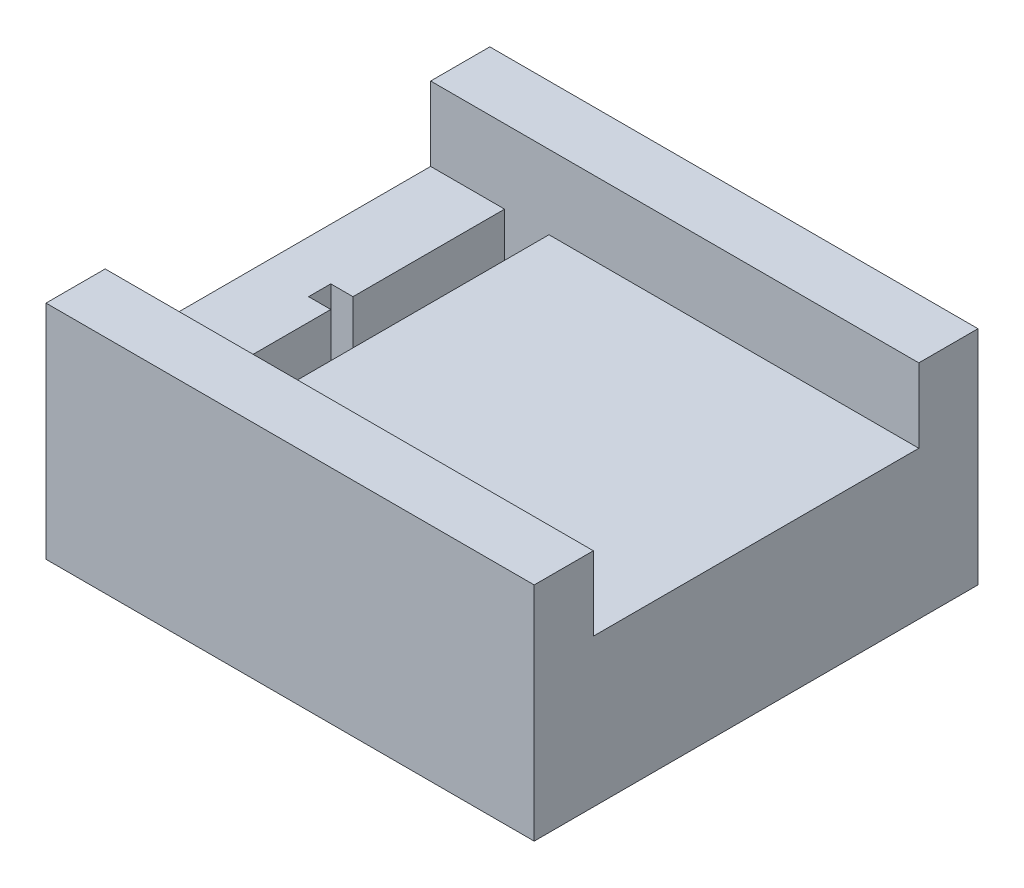
ISO-10303-21;
HEADER;
FILE_DESCRIPTION(('STEP AP214'),'2;1');
FILE_NAME('part.step','',(''),(''),'','','');
FILE_SCHEMA(('AUTOMOTIVE_DESIGN { 1 0 10303 214 1 1 1 1 }'));
ENDSEC;
DATA;
#1=APPLICATION_CONTEXT('core data for automotive mechanical design processes');
#2=APPLICATION_PROTOCOL_DEFINITION('international standard','automotive_design',2000,#1);
#3=PRODUCT_CONTEXT('',#1,'mechanical');
#4=PRODUCT('Part','Part','',(#3));
#5=PRODUCT_RELATED_PRODUCT_CATEGORY('part','',(#4));
#6=PRODUCT_DEFINITION_FORMATION('','',#4);
#7=PRODUCT_DEFINITION_CONTEXT('part definition',#1,'design');
#8=PRODUCT_DEFINITION('design','',#6,#7);
#9=PRODUCT_DEFINITION_SHAPE('','',#8);
#10=(LENGTH_UNIT() NAMED_UNIT(*) SI_UNIT(.MILLI.,.METRE.));
#11=(NAMED_UNIT(*) PLANE_ANGLE_UNIT() SI_UNIT($,.RADIAN.));
#12=(NAMED_UNIT(*) SI_UNIT($,.STERADIAN.) SOLID_ANGLE_UNIT());
#13=UNCERTAINTY_MEASURE_WITH_UNIT(LENGTH_MEASURE(1.E-05),#10,'distance_accuracy_value','');
#14=(GEOMETRIC_REPRESENTATION_CONTEXT(3) GLOBAL_UNCERTAINTY_ASSIGNED_CONTEXT((#13)) GLOBAL_UNIT_ASSIGNED_CONTEXT((#10,
#11,#12)) REPRESENTATION_CONTEXT('',''));
#15=CARTESIAN_POINT('',(0.,0.,0.));
#16=DIRECTION('',(0.,0.,1.));
#17=DIRECTION('',(1.,0.,0.));
#18=AXIS2_PLACEMENT_3D('',#15,#16,#17);
#19=CARTESIAN_POINT('',(0.,3.,0.));
#20=DIRECTION('',(0.,1.,0.));
#21=DIRECTION('',(0.,0.,1.));
#22=AXIS2_PLACEMENT_3D('',#19,#20,#21);
#23=PLANE('',#22);
#24=DIRECTION('',(-1.,0.,0.));
#25=VECTOR('',#24,1.);
#26=CARTESIAN_POINT('',(0.,3.,-11.));
#27=LINE('',#26,#25);
#28=CARTESIAN_POINT('',(-12.5,3.,-11.));
#29=VERTEX_POINT('',#28);
#30=CARTESIAN_POINT('',(-15.5,3.,-11.));
#31=VERTEX_POINT('',#30);
#32=EDGE_CURVE('E267',#29,#31,#27,.T.);
#33=ORIENTED_EDGE('',*,*,#32,.T.);
#34=DIRECTION('',(0.,0.,1.));
#35=VECTOR('',#34,1.);
#36=CARTESIAN_POINT('',(-15.5,3.,0.));
#37=LINE('',#36,#35);
#38=CARTESIAN_POINT('',(-15.5,3.,11.));
#39=VERTEX_POINT('',#38);
#40=EDGE_CURVE('E270',#31,#39,#37,.T.);
#41=ORIENTED_EDGE('',*,*,#40,.T.);
#42=DIRECTION('',(-1.,0.,0.));
#43=VECTOR('',#42,1.);
#44=CARTESIAN_POINT('',(0.,3.,11.));
#45=LINE('',#44,#43);
#46=CARTESIAN_POINT('',(-12.5,3.,11.));
#47=VERTEX_POINT('',#46);
#48=EDGE_CURVE('E41',#47,#39,#45,.T.);
#49=ORIENTED_EDGE('',*,*,#48,.F.);
#50=DIRECTION('',(0.,0.,-1.));
#51=VECTOR('',#50,1.);
#52=CARTESIAN_POINT('',(-12.5,3.,0.));
#53=LINE('',#52,#51);
#54=EDGE_CURVE('E11',#47,#29,#53,.T.);
#55=ORIENTED_EDGE('',*,*,#54,.T.);
#56=EDGE_LOOP('',(#33,#41,#49,#55));
#57=FACE_BOUND('',#56,.T.);
#58=ADVANCED_FACE('F33',(#57),#23,.T.);
#59=CARTESIAN_POINT('',(0.,0.,0.));
#60=DIRECTION('',(0.,1.,0.));
#61=DIRECTION('',(0.,0.,1.));
#62=AXIS2_PLACEMENT_3D('',#59,#60,#61);
#63=PLANE('',#62);
#64=DIRECTION('',(0.,0.,1.));
#65=VECTOR('',#64,1.);
#66=CARTESIAN_POINT('',(-20.5,0.,0.));
#67=LINE('',#66,#65);
#68=CARTESIAN_POINT('',(-20.5,0.,-15.));
#69=VERTEX_POINT('',#68);
#70=CARTESIAN_POINT('',(-20.5,0.,15.));
#71=VERTEX_POINT('',#70);
#72=EDGE_CURVE('E230',#69,#71,#67,.T.);
#73=ORIENTED_EDGE('',*,*,#72,.F.);
#74=DIRECTION('',(1.,0.,0.));
#75=VECTOR('',#74,1.);
#76=CARTESIAN_POINT('',(0.,0.,-15.));
#77=LINE('',#76,#75);
#78=CARTESIAN_POINT('',(12.5,0.,-15.));
#79=VERTEX_POINT('',#78);
#80=EDGE_CURVE('E205',#69,#79,#77,.T.);
#81=ORIENTED_EDGE('',*,*,#80,.T.);
#82=DIRECTION('',(0.,0.,-1.));
#83=VECTOR('',#82,1.);
#84=CARTESIAN_POINT('',(12.5,0.,0.));
#85=LINE('',#84,#83);
#86=CARTESIAN_POINT('',(12.5,0.,15.));
#87=VERTEX_POINT('',#86);
#88=EDGE_CURVE('E247',#87,#79,#85,.T.);
#89=ORIENTED_EDGE('',*,*,#88,.F.);
#90=DIRECTION('',(1.,0.,0.));
#91=VECTOR('',#90,1.);
#92=CARTESIAN_POINT('',(0.,0.,15.));
#93=LINE('',#92,#91);
#94=EDGE_CURVE('E178',#71,#87,#93,.T.);
#95=ORIENTED_EDGE('',*,*,#94,.F.);
#96=EDGE_LOOP('',(#73,#81,#89,#95));
#97=FACE_BOUND('',#96,.T.);
#98=ADVANCED_FACE('F35',(#97),#63,.F.);
#99=CARTESIAN_POINT('',(-12.5,10.,0.));
#100=DIRECTION('',(-1.,0.,0.));
#101=DIRECTION('',(0.,0.,1.));
#102=AXIS2_PLACEMENT_3D('',#99,#100,#101);
#103=PLANE('',#102);
#104=ORIENTED_EDGE('',*,*,#54,.F.);
#105=DIRECTION('',(0.,-1.,0.));
#106=VECTOR('',#105,1.);
#107=CARTESIAN_POINT('',(-12.5,10.,11.));
#108=LINE('',#107,#106);
#109=CARTESIAN_POINT('',(-12.5,10.,11.));
#110=VERTEX_POINT('',#109);
#111=EDGE_CURVE('E264',#110,#47,#108,.T.);
#112=ORIENTED_EDGE('',*,*,#111,.F.);
#113=DIRECTION('',(0.,0.,-1.));
#114=VECTOR('',#113,1.);
#115=CARTESIAN_POINT('',(-12.5,10.,0.));
#116=LINE('',#115,#114);
#117=CARTESIAN_POINT('',(-12.5,10.,-11.));
#118=VERTEX_POINT('',#117);
#119=EDGE_CURVE('E248',#110,#118,#116,.T.);
#120=ORIENTED_EDGE('',*,*,#119,.T.);
#121=DIRECTION('',(0.,-1.,0.));
#122=VECTOR('',#121,1.);
#123=CARTESIAN_POINT('',(-12.5,10.,-11.));
#124=LINE('',#123,#122);
#125=EDGE_CURVE('E260',#118,#29,#124,.T.);
#126=ORIENTED_EDGE('',*,*,#125,.T.);
#127=EDGE_LOOP('',(#104,#112,#120,#126));
#128=FACE_BOUND('',#127,.T.);
#129=ADVANCED_FACE('F308',(#128),#103,.T.);
#130=CARTESIAN_POINT('',(12.5,10.,0.));
#131=DIRECTION('',(-1.,0.,0.));
#132=DIRECTION('',(0.,0.,1.));
#133=AXIS2_PLACEMENT_3D('',#130,#131,#132);
#134=PLANE('',#133);
#135=ORIENTED_EDGE('',*,*,#88,.T.);
#136=DIRECTION('',(0.,-1.,0.));
#137=VECTOR('',#136,1.);
#138=CARTESIAN_POINT('',(12.5,15.,-15.));
#139=LINE('',#138,#137);
#140=CARTESIAN_POINT('',(12.5,15.,-15.));
#141=VERTEX_POINT('',#140);
#142=EDGE_CURVE('E224',#141,#79,#139,.T.);
#143=ORIENTED_EDGE('',*,*,#142,.F.);
#144=DIRECTION('',(0.,0.,-1.));
#145=VECTOR('',#144,1.);
#146=CARTESIAN_POINT('',(12.5,15.,0.));
#147=LINE('',#146,#145);
#148=CARTESIAN_POINT('',(12.5,15.,-11.));
#149=VERTEX_POINT('',#148);
#150=EDGE_CURVE('E209',#149,#141,#147,.T.);
#151=ORIENTED_EDGE('',*,*,#150,.F.);
#152=DIRECTION('',(0.,-1.,0.));
#153=VECTOR('',#152,1.);
#154=CARTESIAN_POINT('',(12.5,15.,-11.));
#155=LINE('',#154,#153);
#156=CARTESIAN_POINT('',(12.5,10.,-11.));
#157=VERTEX_POINT('',#156);
#158=EDGE_CURVE('E227',#149,#157,#155,.T.);
#159=ORIENTED_EDGE('',*,*,#158,.T.);
#160=DIRECTION('',(0.,0.,-1.));
#161=VECTOR('',#160,1.);
#162=CARTESIAN_POINT('',(12.5,10.,0.));
#163=LINE('',#162,#161);
#164=CARTESIAN_POINT('',(12.5,10.,11.));
#165=VERTEX_POINT('',#164);
#166=EDGE_CURVE('E254',#165,#157,#163,.T.);
#167=ORIENTED_EDGE('',*,*,#166,.F.);
#168=DIRECTION('',(0.,-1.,0.));
#169=VECTOR('',#168,1.);
#170=CARTESIAN_POINT('',(12.5,15.,11.));
#171=LINE('',#170,#169);
#172=CARTESIAN_POINT('',(12.5,15.,11.));
#173=VERTEX_POINT('',#172);
#174=EDGE_CURVE('E202',#173,#165,#171,.T.);
#175=ORIENTED_EDGE('',*,*,#174,.F.);
#176=DIRECTION('',(0.,0.,1.));
#177=VECTOR('',#176,1.);
#178=CARTESIAN_POINT('',(12.5,15.,0.));
#179=LINE('',#178,#177);
#180=CARTESIAN_POINT('',(12.5,15.,15.));
#181=VERTEX_POINT('',#180);
#182=EDGE_CURVE('E182',#173,#181,#179,.T.);
#183=ORIENTED_EDGE('',*,*,#182,.T.);
#184=DIRECTION('',(0.,-1.,0.));
#185=VECTOR('',#184,1.);
#186=CARTESIAN_POINT('',(12.5,15.,15.));
#187=LINE('',#186,#185);
#188=EDGE_CURVE('E191',#181,#87,#187,.T.);
#189=ORIENTED_EDGE('',*,*,#188,.T.);
#190=EDGE_LOOP('',(#135,#143,#151,#159,#167,#175,#183,#189));
#191=FACE_BOUND('',#190,.T.);
#192=ADVANCED_FACE('F302',(#191),#134,.F.);
#193=CARTESIAN_POINT('',(0.,10.,0.));
#194=DIRECTION('',(0.,1.,0.));
#195=DIRECTION('',(0.,0.,1.));
#196=AXIS2_PLACEMENT_3D('',#193,#194,#195);
#197=PLANE('',#196);
#198=ORIENTED_EDGE('',*,*,#119,.F.);
#199=DIRECTION('',(-1.,0.,0.));
#200=VECTOR('',#199,1.);
#201=CARTESIAN_POINT('',(0.,10.,11.));
#202=LINE('',#201,#200);
#203=EDGE_CURVE('E251',#165,#110,#202,.T.);
#204=ORIENTED_EDGE('',*,*,#203,.F.);
#205=ORIENTED_EDGE('',*,*,#166,.T.);
#206=DIRECTION('',(-1.,0.,0.));
#207=VECTOR('',#206,1.);
#208=CARTESIAN_POINT('',(0.,10.,-11.));
#209=LINE('',#208,#207);
#210=EDGE_CURVE('E257',#157,#118,#209,.T.);
#211=ORIENTED_EDGE('',*,*,#210,.T.);
#212=EDGE_LOOP('',(#198,#204,#205,#211));
#213=FACE_BOUND('',#212,.T.);
#214=ADVANCED_FACE('F306',(#213),#197,.T.);
#215=CARTESIAN_POINT('',(-15.5,10.,0.));
#216=DIRECTION('',(1.,0.,0.));
#217=DIRECTION('',(0.,0.,-1.));
#218=AXIS2_PLACEMENT_3D('',#215,#216,#217);
#219=PLANE('',#218);
#220=DIRECTION('',(0.,1.,0.));
#221=VECTOR('',#220,1.);
#222=CARTESIAN_POINT('',(-15.5,4.,-0.749999999999992));
#223=LINE('',#222,#221);
#224=CARTESIAN_POINT('',(-15.5,4.,-0.749999999999992));
#225=VERTEX_POINT('',#224);
#226=CARTESIAN_POINT('',(-15.5,10.,-0.749999999999992));
#227=VERTEX_POINT('',#226);
#228=EDGE_CURVE('E179',#225,#227,#223,.T.);
#229=ORIENTED_EDGE('',*,*,#228,.F.);
#230=DIRECTION('',(0.,0.,-1.));
#231=VECTOR('',#230,1.);
#232=CARTESIAN_POINT('',(-15.5,4.,-0.749999999999992));
#233=LINE('',#232,#231);
#234=CARTESIAN_POINT('',(-15.5,4.,0.750000000000008));
#235=VERTEX_POINT('',#234);
#236=EDGE_CURVE('E162',#235,#225,#233,.T.);
#237=ORIENTED_EDGE('',*,*,#236,.F.);
#238=DIRECTION('',(0.,1.,0.));
#239=VECTOR('',#238,1.);
#240=CARTESIAN_POINT('',(-15.5,4.,0.750000000000008));
#241=LINE('',#240,#239);
#242=CARTESIAN_POINT('',(-15.5,10.,0.750000000000008));
#243=VERTEX_POINT('',#242);
#244=EDGE_CURVE('E153',#235,#243,#241,.T.);
#245=ORIENTED_EDGE('',*,*,#244,.T.);
#246=DIRECTION('',(0.,0.,1.));
#247=VECTOR('',#246,1.);
#248=CARTESIAN_POINT('',(-15.5,10.,0.));
#249=LINE('',#248,#247);
#250=CARTESIAN_POINT('',(-15.5,10.,11.));
#251=VERTEX_POINT('',#250);
#252=EDGE_CURVE('E239',#243,#251,#249,.T.);
#253=ORIENTED_EDGE('',*,*,#252,.T.);
#254=DIRECTION('',(0.,-1.,0.));
#255=VECTOR('',#254,1.);
#256=CARTESIAN_POINT('',(-15.5,10.,11.));
#257=LINE('',#256,#255);
#258=EDGE_CURVE('E56',#251,#39,#257,.T.);
#259=ORIENTED_EDGE('',*,*,#258,.T.);
#260=ORIENTED_EDGE('',*,*,#40,.F.);
#261=DIRECTION('',(0.,-1.,0.));
#262=VECTOR('',#261,1.);
#263=CARTESIAN_POINT('',(-15.5,10.,-11.));
#264=LINE('',#263,#262);
#265=CARTESIAN_POINT('',(-15.5,10.,-11.));
#266=VERTEX_POINT('',#265);
#267=EDGE_CURVE('E243',#266,#31,#264,.T.);
#268=ORIENTED_EDGE('',*,*,#267,.F.);
#269=EDGE_CURVE('E240',#266,#227,#249,.T.);
#270=ORIENTED_EDGE('',*,*,#269,.T.);
#271=EDGE_LOOP('',(#229,#237,#245,#253,#259,#260,#268,#270));
#272=FACE_BOUND('',#271,.T.);
#273=ADVANCED_FACE('F278',(#272),#219,.T.);
#274=CARTESIAN_POINT('',(-20.5,10.,0.));
#275=DIRECTION('',(1.,0.,0.));
#276=DIRECTION('',(0.,0.,-1.));
#277=AXIS2_PLACEMENT_3D('',#274,#275,#276);
#278=PLANE('',#277);
#279=ORIENTED_EDGE('',*,*,#72,.T.);
#280=DIRECTION('',(0.,-1.,0.));
#281=VECTOR('',#280,1.);
#282=CARTESIAN_POINT('',(-20.5,15.,15.));
#283=LINE('',#282,#281);
#284=CARTESIAN_POINT('',(-20.5,15.,15.));
#285=VERTEX_POINT('',#284);
#286=EDGE_CURVE('E196',#285,#71,#283,.T.);
#287=ORIENTED_EDGE('',*,*,#286,.F.);
#288=DIRECTION('',(0.,0.,1.));
#289=VECTOR('',#288,1.);
#290=CARTESIAN_POINT('',(-20.5,15.,0.));
#291=LINE('',#290,#289);
#292=CARTESIAN_POINT('',(-20.5,15.,11.));
#293=VERTEX_POINT('',#292);
#294=EDGE_CURVE('E187',#293,#285,#291,.T.);
#295=ORIENTED_EDGE('',*,*,#294,.F.);
#296=DIRECTION('',(0.,-1.,0.));
#297=VECTOR('',#296,1.);
#298=CARTESIAN_POINT('',(-20.5,15.,11.));
#299=LINE('',#298,#297);
#300=CARTESIAN_POINT('',(-20.5,10.,11.));
#301=VERTEX_POINT('',#300);
#302=EDGE_CURVE('E199',#293,#301,#299,.T.);
#303=ORIENTED_EDGE('',*,*,#302,.T.);
#304=DIRECTION('',(0.,0.,1.));
#305=VECTOR('',#304,1.);
#306=CARTESIAN_POINT('',(-20.5,10.,0.));
#307=LINE('',#306,#305);
#308=CARTESIAN_POINT('',(-20.5,10.,-11.));
#309=VERTEX_POINT('',#308);
#310=EDGE_CURVE('E234',#309,#301,#307,.T.);
#311=ORIENTED_EDGE('',*,*,#310,.F.);
#312=DIRECTION('',(0.,-1.,0.));
#313=VECTOR('',#312,1.);
#314=CARTESIAN_POINT('',(-20.5,15.,-11.));
#315=LINE('',#314,#313);
#316=CARTESIAN_POINT('',(-20.5,15.,-11.));
#317=VERTEX_POINT('',#316);
#318=EDGE_CURVE('E217',#317,#309,#315,.T.);
#319=ORIENTED_EDGE('',*,*,#318,.F.);
#320=DIRECTION('',(0.,0.,-1.));
#321=VECTOR('',#320,1.);
#322=CARTESIAN_POINT('',(-20.5,15.,0.));
#323=LINE('',#322,#321);
#324=CARTESIAN_POINT('',(-20.5,15.,-15.));
#325=VERTEX_POINT('',#324);
#326=EDGE_CURVE('E214',#317,#325,#323,.T.);
#327=ORIENTED_EDGE('',*,*,#326,.T.);
#328=DIRECTION('',(0.,-1.,0.));
#329=VECTOR('',#328,1.);
#330=CARTESIAN_POINT('',(-20.5,15.,-15.));
#331=LINE('',#330,#329);
#332=EDGE_CURVE('E221',#325,#69,#331,.T.);
#333=ORIENTED_EDGE('',*,*,#332,.T.);
#334=EDGE_LOOP('',(#279,#287,#295,#303,#311,#319,#327,#333));
#335=FACE_BOUND('',#334,.T.);
#336=ADVANCED_FACE('F293',(#335),#278,.F.);
#337=CARTESIAN_POINT('',(0.,10.,0.));
#338=DIRECTION('',(0.,1.,0.));
#339=DIRECTION('',(0.,0.,1.));
#340=AXIS2_PLACEMENT_3D('',#337,#338,#339);
#341=PLANE('',#340);
#342=DIRECTION('',(-1.,0.,0.));
#343=VECTOR('',#342,1.);
#344=CARTESIAN_POINT('',(-17.,10.,-0.749999999999992));
#345=LINE('',#344,#343);
#346=CARTESIAN_POINT('',(-17.,10.,-0.749999999999992));
#347=VERTEX_POINT('',#346);
#348=EDGE_CURVE('E166',#227,#347,#345,.T.);
#349=ORIENTED_EDGE('',*,*,#348,.F.);
#350=ORIENTED_EDGE('',*,*,#269,.F.);
#351=DIRECTION('',(-1.,0.,0.));
#352=VECTOR('',#351,1.);
#353=CARTESIAN_POINT('',(0.,10.,-11.));
#354=LINE('',#353,#352);
#355=EDGE_CURVE('E231',#266,#309,#354,.T.);
#356=ORIENTED_EDGE('',*,*,#355,.T.);
#357=ORIENTED_EDGE('',*,*,#310,.T.);
#358=DIRECTION('',(-1.,0.,0.));
#359=VECTOR('',#358,1.);
#360=CARTESIAN_POINT('',(0.,10.,11.));
#361=LINE('',#360,#359);
#362=EDGE_CURVE('E236',#251,#301,#361,.T.);
#363=ORIENTED_EDGE('',*,*,#362,.F.);
#364=ORIENTED_EDGE('',*,*,#252,.F.);
#365=DIRECTION('',(1.,0.,0.));
#366=VECTOR('',#365,1.);
#367=CARTESIAN_POINT('',(-17.,10.,0.750000000000008));
#368=LINE('',#367,#366);
#369=CARTESIAN_POINT('',(-17.,10.,0.750000000000008));
#370=VERTEX_POINT('',#369);
#371=EDGE_CURVE('E169',#370,#243,#368,.T.);
#372=ORIENTED_EDGE('',*,*,#371,.F.);
#373=DIRECTION('',(0.,0.,1.));
#374=VECTOR('',#373,1.);
#375=CARTESIAN_POINT('',(-17.,10.,-0.749999999999992));
#376=LINE('',#375,#374);
#377=EDGE_CURVE('E48',#347,#370,#376,.T.);
#378=ORIENTED_EDGE('',*,*,#377,.F.);
#379=EDGE_LOOP('',(#349,#350,#356,#357,#363,#364,#372,#378));
#380=FACE_BOUND('',#379,.T.);
#381=ADVANCED_FACE('F283',(#380),#341,.T.);
#382=CARTESIAN_POINT('',(0.,15.,-11.));
#383=DIRECTION('',(0.,0.,1.));
#384=DIRECTION('',(1.,0.,0.));
#385=AXIS2_PLACEMENT_3D('',#382,#383,#384);
#386=PLANE('',#385);
#387=ORIENTED_EDGE('',*,*,#355,.F.);
#388=ORIENTED_EDGE('',*,*,#267,.T.);
#389=ORIENTED_EDGE('',*,*,#32,.F.);
#390=ORIENTED_EDGE('',*,*,#125,.F.);
#391=ORIENTED_EDGE('',*,*,#210,.F.);
#392=ORIENTED_EDGE('',*,*,#158,.F.);
#393=DIRECTION('',(-1.,0.,0.));
#394=VECTOR('',#393,1.);
#395=CARTESIAN_POINT('',(0.,15.,-11.));
#396=LINE('',#395,#394);
#397=EDGE_CURVE('E206',#149,#317,#396,.T.);
#398=ORIENTED_EDGE('',*,*,#397,.T.);
#399=ORIENTED_EDGE('',*,*,#318,.T.);
#400=EDGE_LOOP('',(#387,#388,#389,#390,#391,#392,#398,#399));
#401=FACE_BOUND('',#400,.T.);
#402=ADVANCED_FACE('F309',(#401),#386,.T.);
#403=CARTESIAN_POINT('',(0.,15.,-15.));
#404=DIRECTION('',(0.,0.,-1.));
#405=DIRECTION('',(-1.,0.,0.));
#406=AXIS2_PLACEMENT_3D('',#403,#404,#405);
#407=PLANE('',#406);
#408=ORIENTED_EDGE('',*,*,#80,.F.);
#409=ORIENTED_EDGE('',*,*,#332,.F.);
#410=DIRECTION('',(1.,0.,0.));
#411=VECTOR('',#410,1.);
#412=CARTESIAN_POINT('',(0.,15.,-15.));
#413=LINE('',#412,#411);
#414=EDGE_CURVE('E211',#325,#141,#413,.T.);
#415=ORIENTED_EDGE('',*,*,#414,.T.);
#416=ORIENTED_EDGE('',*,*,#142,.T.);
#417=EDGE_LOOP('',(#408,#409,#415,#416));
#418=FACE_BOUND('',#417,.T.);
#419=ADVANCED_FACE('F318',(#418),#407,.T.);
#420=CARTESIAN_POINT('',(0.,15.,0.));
#421=DIRECTION('',(0.,1.,0.));
#422=DIRECTION('',(0.,0.,1.));
#423=AXIS2_PLACEMENT_3D('',#420,#421,#422);
#424=PLANE('',#423);
#425=ORIENTED_EDGE('',*,*,#397,.F.);
#426=ORIENTED_EDGE('',*,*,#150,.T.);
#427=ORIENTED_EDGE('',*,*,#414,.F.);
#428=ORIENTED_EDGE('',*,*,#326,.F.);
#429=EDGE_LOOP('',(#425,#426,#427,#428));
#430=FACE_BOUND('',#429,.T.);
#431=ADVANCED_FACE('F315',(#430),#424,.T.);
#432=CARTESIAN_POINT('',(0.,15.,11.));
#433=DIRECTION('',(0.,0.,1.));
#434=DIRECTION('',(1.,0.,0.));
#435=AXIS2_PLACEMENT_3D('',#432,#433,#434);
#436=PLANE('',#435);
#437=ORIENTED_EDGE('',*,*,#174,.T.);
#438=ORIENTED_EDGE('',*,*,#203,.T.);
#439=ORIENTED_EDGE('',*,*,#111,.T.);
#440=ORIENTED_EDGE('',*,*,#48,.T.);
#441=ORIENTED_EDGE('',*,*,#258,.F.);
#442=ORIENTED_EDGE('',*,*,#362,.T.);
#443=ORIENTED_EDGE('',*,*,#302,.F.);
#444=DIRECTION('',(-1.,0.,0.));
#445=VECTOR('',#444,1.);
#446=CARTESIAN_POINT('',(0.,15.,11.));
#447=LINE('',#446,#445);
#448=EDGE_CURVE('E185',#173,#293,#447,.T.);
#449=ORIENTED_EDGE('',*,*,#448,.F.);
#450=EDGE_LOOP('',(#437,#438,#439,#440,#441,#442,#443,#449));
#451=FACE_BOUND('',#450,.T.);
#452=ADVANCED_FACE('F274',(#451),#436,.F.);
#453=CARTESIAN_POINT('',(0.,15.,15.));
#454=DIRECTION('',(0.,0.,-1.));
#455=DIRECTION('',(-1.,0.,0.));
#456=AXIS2_PLACEMENT_3D('',#453,#454,#455);
#457=PLANE('',#456);
#458=ORIENTED_EDGE('',*,*,#94,.T.);
#459=ORIENTED_EDGE('',*,*,#188,.F.);
#460=DIRECTION('',(1.,0.,0.));
#461=VECTOR('',#460,1.);
#462=CARTESIAN_POINT('',(0.,15.,15.));
#463=LINE('',#462,#461);
#464=EDGE_CURVE('E189',#285,#181,#463,.T.);
#465=ORIENTED_EDGE('',*,*,#464,.F.);
#466=ORIENTED_EDGE('',*,*,#286,.T.);
#467=EDGE_LOOP('',(#458,#459,#465,#466));
#468=FACE_BOUND('',#467,.T.);
#469=ADVANCED_FACE('F322',(#468),#457,.F.);
#470=CARTESIAN_POINT('',(0.,15.,0.));
#471=DIRECTION('',(0.,1.,0.));
#472=DIRECTION('',(0.,0.,1.));
#473=AXIS2_PLACEMENT_3D('',#470,#471,#472);
#474=PLANE('',#473);
#475=ORIENTED_EDGE('',*,*,#182,.F.);
#476=ORIENTED_EDGE('',*,*,#448,.T.);
#477=ORIENTED_EDGE('',*,*,#294,.T.);
#478=ORIENTED_EDGE('',*,*,#464,.T.);
#479=EDGE_LOOP('',(#475,#476,#477,#478));
#480=FACE_BOUND('',#479,.T.);
#481=ADVANCED_FACE('F298',(#480),#474,.T.);
#482=CARTESIAN_POINT('',(-17.,4.,-0.749999999999992));
#483=DIRECTION('',(-1.,0.,0.));
#484=DIRECTION('',(0.,0.,1.));
#485=AXIS2_PLACEMENT_3D('',#482,#483,#484);
#486=PLANE('',#485);
#487=ORIENTED_EDGE('',*,*,#377,.T.);
#488=DIRECTION('',(0.,1.,0.));
#489=VECTOR('',#488,1.);
#490=CARTESIAN_POINT('',(-17.,4.,0.750000000000008));
#491=LINE('',#490,#489);
#492=CARTESIAN_POINT('',(-17.,4.,0.750000000000008));
#493=VERTEX_POINT('',#492);
#494=EDGE_CURVE('E145',#493,#370,#491,.T.);
#495=ORIENTED_EDGE('',*,*,#494,.F.);
#496=DIRECTION('',(0.,0.,1.));
#497=VECTOR('',#496,1.);
#498=CARTESIAN_POINT('',(-17.,4.,-0.749999999999992));
#499=LINE('',#498,#497);
#500=CARTESIAN_POINT('',(-17.,4.,-0.749999999999992));
#501=VERTEX_POINT('',#500);
#502=EDGE_CURVE('E149',#501,#493,#499,.T.);
#503=ORIENTED_EDGE('',*,*,#502,.F.);
#504=DIRECTION('',(0.,1.,0.));
#505=VECTOR('',#504,1.);
#506=CARTESIAN_POINT('',(-17.,4.,-0.749999999999992));
#507=LINE('',#506,#505);
#508=EDGE_CURVE('E176',#501,#347,#507,.T.);
#509=ORIENTED_EDGE('',*,*,#508,.T.);
#510=EDGE_LOOP('',(#487,#495,#503,#509));
#511=FACE_BOUND('',#510,.T.);
#512=ADVANCED_FACE('F147',(#511),#486,.F.);
#513=CARTESIAN_POINT('',(-17.,4.,-0.749999999999992));
#514=DIRECTION('',(0.,0.,-1.));
#515=DIRECTION('',(-1.,0.,0.));
#516=AXIS2_PLACEMENT_3D('',#513,#514,#515);
#517=PLANE('',#516);
#518=ORIENTED_EDGE('',*,*,#348,.T.);
#519=ORIENTED_EDGE('',*,*,#508,.F.);
#520=DIRECTION('',(-1.,0.,0.));
#521=VECTOR('',#520,1.);
#522=CARTESIAN_POINT('',(-17.,4.,-0.749999999999992));
#523=LINE('',#522,#521);
#524=EDGE_CURVE('E154',#225,#501,#523,.T.);
#525=ORIENTED_EDGE('',*,*,#524,.F.);
#526=ORIENTED_EDGE('',*,*,#228,.T.);
#527=EDGE_LOOP('',(#518,#519,#525,#526));
#528=FACE_BOUND('',#527,.T.);
#529=ADVANCED_FACE('F285',(#528),#517,.F.);
#530=CARTESIAN_POINT('',(-17.,4.,0.750000000000008));
#531=DIRECTION('',(0.,0.,1.));
#532=DIRECTION('',(1.,0.,0.));
#533=AXIS2_PLACEMENT_3D('',#530,#531,#532);
#534=PLANE('',#533);
#535=ORIENTED_EDGE('',*,*,#371,.T.);
#536=ORIENTED_EDGE('',*,*,#244,.F.);
#537=DIRECTION('',(1.,0.,0.));
#538=VECTOR('',#537,1.);
#539=CARTESIAN_POINT('',(-17.,4.,0.750000000000008));
#540=LINE('',#539,#538);
#541=EDGE_CURVE('E157',#493,#235,#540,.T.);
#542=ORIENTED_EDGE('',*,*,#541,.F.);
#543=ORIENTED_EDGE('',*,*,#494,.T.);
#544=EDGE_LOOP('',(#535,#536,#542,#543));
#545=FACE_BOUND('',#544,.T.);
#546=ADVANCED_FACE('F158',(#545),#534,.F.);
#547=CARTESIAN_POINT('',(0.,4.,0.));
#548=DIRECTION('',(0.,1.,0.));
#549=DIRECTION('',(0.,0.,1.));
#550=AXIS2_PLACEMENT_3D('',#547,#548,#549);
#551=PLANE('',#550);
#552=ORIENTED_EDGE('',*,*,#502,.T.);
#553=ORIENTED_EDGE('',*,*,#541,.T.);
#554=ORIENTED_EDGE('',*,*,#236,.T.);
#555=ORIENTED_EDGE('',*,*,#524,.T.);
#556=EDGE_LOOP('',(#552,#553,#554,#555));
#557=FACE_BOUND('',#556,.T.);
#558=ADVANCED_FACE('F164',(#557),#551,.T.);
#559=CLOSED_SHELL('',(#58,#98,#129,#192,#214,#273,#336,#381,#402,#419,#431,#452,#469,#481,#512,
#529,#546,#558));
#560=MANIFOLD_SOLID_BREP('B2',#559);
#561=ADVANCED_BREP_SHAPE_REPRESENTATION('',(#18,#560),#14);
#562=SHAPE_DEFINITION_REPRESENTATION(#9,#561);
ENDSEC;
END-ISO-10303-21;
